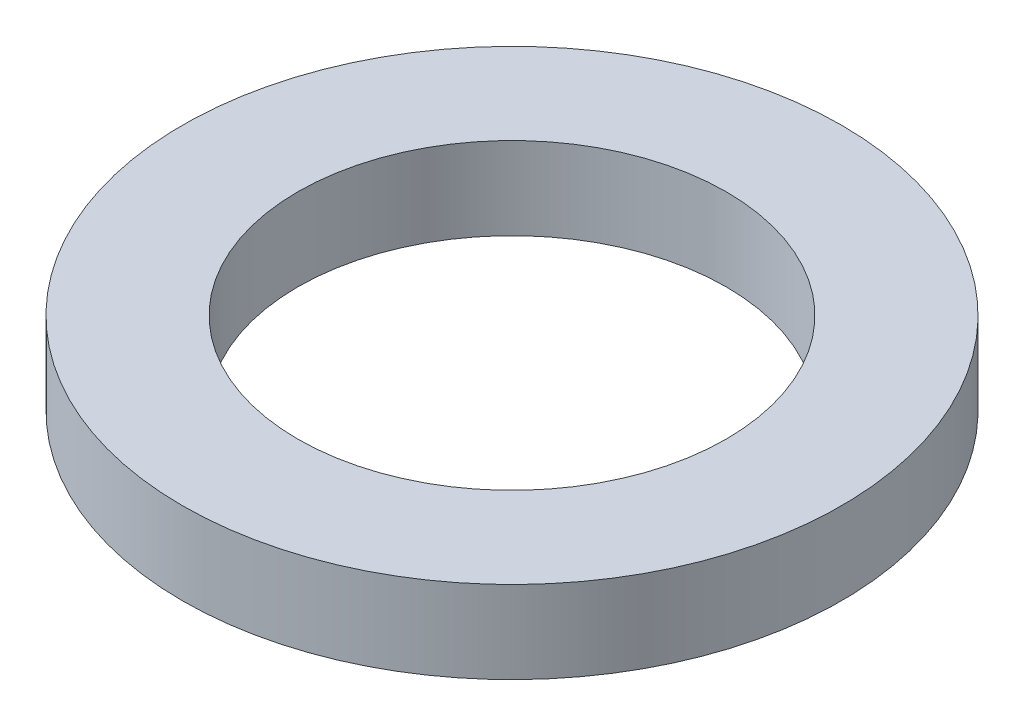
ISO-10303-21;
HEADER;
FILE_DESCRIPTION(('STEP AP214'),'2;1');
FILE_NAME('part.step','',(''),(''),'','','');
FILE_SCHEMA(('AUTOMOTIVE_DESIGN { 1 0 10303 214 1 1 1 1 }'));
ENDSEC;
DATA;
#1=APPLICATION_CONTEXT('core data for automotive mechanical design processes');
#2=APPLICATION_PROTOCOL_DEFINITION('international standard','automotive_design',2000,#1);
#3=PRODUCT_CONTEXT('',#1,'mechanical');
#4=PRODUCT('Part','Part','',(#3));
#5=PRODUCT_RELATED_PRODUCT_CATEGORY('part','',(#4));
#6=PRODUCT_DEFINITION_FORMATION('','',#4);
#7=PRODUCT_DEFINITION_CONTEXT('part definition',#1,'design');
#8=PRODUCT_DEFINITION('design','',#6,#7);
#9=PRODUCT_DEFINITION_SHAPE('','',#8);
#10=(LENGTH_UNIT() NAMED_UNIT(*) SI_UNIT(.MILLI.,.METRE.));
#11=(NAMED_UNIT(*) PLANE_ANGLE_UNIT() SI_UNIT($,.RADIAN.));
#12=(NAMED_UNIT(*) SI_UNIT($,.STERADIAN.) SOLID_ANGLE_UNIT());
#13=UNCERTAINTY_MEASURE_WITH_UNIT(LENGTH_MEASURE(1.E-05),#10,'distance_accuracy_value','');
#14=(GEOMETRIC_REPRESENTATION_CONTEXT(3) GLOBAL_UNCERTAINTY_ASSIGNED_CONTEXT((#13)) GLOBAL_UNIT_ASSIGNED_CONTEXT((#10,
#11,#12)) REPRESENTATION_CONTEXT('',''));
#15=CARTESIAN_POINT('',(0.,0.,0.));
#16=DIRECTION('',(0.,0.,1.));
#17=DIRECTION('',(1.,0.,0.));
#18=AXIS2_PLACEMENT_3D('',#15,#16,#17);
#19=CARTESIAN_POINT('',(0.,1.,0.));
#20=DIRECTION('',(0.,1.,0.));
#21=DIRECTION('',(0.,0.,1.));
#22=AXIS2_PLACEMENT_3D('',#19,#20,#21);
#23=PLANE('',#22);
#24=CARTESIAN_POINT('',(0.,1.,0.));
#25=DIRECTION('',(0.,1.,0.));
#26=DIRECTION('',(0.,0.,1.));
#27=AXIS2_PLACEMENT_3D('',#24,#25,#26);
#28=CIRCLE('',#27,4.);
#29=CARTESIAN_POINT('',(0.,1.,4.));
#30=VERTEX_POINT('',#29);
#31=EDGE_CURVE('E10',#30,#30,#28,.T.);
#32=ORIENTED_EDGE('',*,*,#31,.T.);
#33=EDGE_LOOP('',(#32));
#34=FACE_BOUND('',#33,.T.);
#35=CARTESIAN_POINT('',(0.,1.,0.));
#36=DIRECTION('',(0.,1.,0.));
#37=DIRECTION('',(0.,0.,1.));
#38=AXIS2_PLACEMENT_3D('',#35,#36,#37);
#39=CIRCLE('',#38,2.6);
#40=CARTESIAN_POINT('',(0.,1.,2.6));
#41=VERTEX_POINT('',#40);
#42=EDGE_CURVE('E50',#41,#41,#39,.T.);
#43=ORIENTED_EDGE('',*,*,#42,.F.);
#44=EDGE_LOOP('',(#43));
#45=FACE_BOUND('',#44,.T.);
#46=ADVANCED_FACE('F37',(#34,#45),#23,.T.);
#47=CARTESIAN_POINT('',(0.,0.,0.));
#48=DIRECTION('',(0.,1.,0.));
#49=DIRECTION('',(0.,0.,1.));
#50=AXIS2_PLACEMENT_3D('',#47,#48,#49);
#51=PLANE('',#50);
#52=CARTESIAN_POINT('',(0.,0.,0.));
#53=DIRECTION('',(0.,1.,0.));
#54=DIRECTION('',(0.,0.,1.));
#55=AXIS2_PLACEMENT_3D('',#52,#53,#54);
#56=CIRCLE('',#55,4.);
#57=CARTESIAN_POINT('',(0.,0.,4.));
#58=VERTEX_POINT('',#57);
#59=EDGE_CURVE('E41',#58,#58,#56,.T.);
#60=ORIENTED_EDGE('',*,*,#59,.F.);
#61=EDGE_LOOP('',(#60));
#62=FACE_BOUND('',#61,.T.);
#63=CARTESIAN_POINT('',(0.,0.,0.));
#64=DIRECTION('',(0.,1.,0.));
#65=DIRECTION('',(0.,0.,1.));
#66=AXIS2_PLACEMENT_3D('',#63,#64,#65);
#67=CIRCLE('',#66,2.6);
#68=CARTESIAN_POINT('',(0.,0.,2.6));
#69=VERTEX_POINT('',#68);
#70=EDGE_CURVE('E52',#69,#69,#67,.T.);
#71=ORIENTED_EDGE('',*,*,#70,.T.);
#72=EDGE_LOOP('',(#71));
#73=FACE_BOUND('',#72,.T.);
#74=ADVANCED_FACE('F64',(#62,#73),#51,.F.);
#75=CARTESIAN_POINT('',(0.,1.,0.));
#76=DIRECTION('',(0.,-1.,0.));
#77=DIRECTION('',(0.,0.,-1.));
#78=AXIS2_PLACEMENT_3D('',#75,#76,#77);
#79=CYLINDRICAL_SURFACE('',#78,4.);
#80=ORIENTED_EDGE('',*,*,#31,.F.);
#81=EDGE_LOOP('',(#80));
#82=FACE_BOUND('',#81,.T.);
#83=ORIENTED_EDGE('',*,*,#59,.T.);
#84=EDGE_LOOP('',(#83));
#85=FACE_BOUND('',#84,.T.);
#86=ADVANCED_FACE('F39',(#82,#85),#79,.T.);
#87=CARTESIAN_POINT('',(0.,1.,0.));
#88=DIRECTION('',(0.,-1.,0.));
#89=DIRECTION('',(0.,0.,-1.));
#90=AXIS2_PLACEMENT_3D('',#87,#88,#89);
#91=CYLINDRICAL_SURFACE('',#90,2.6);
#92=ORIENTED_EDGE('',*,*,#42,.T.);
#93=EDGE_LOOP('',(#92));
#94=FACE_BOUND('',#93,.T.);
#95=ORIENTED_EDGE('',*,*,#70,.F.);
#96=EDGE_LOOP('',(#95));
#97=FACE_BOUND('',#96,.T.);
#98=ADVANCED_FACE('F60',(#94,#97),#91,.F.);
#99=CLOSED_SHELL('',(#46,#74,#86,#98));
#100=MANIFOLD_SOLID_BREP('B2',#99);
#101=ADVANCED_BREP_SHAPE_REPRESENTATION('',(#18,#100),#14);
#102=SHAPE_DEFINITION_REPRESENTATION(#9,#101);
ENDSEC;
END-ISO-10303-21;
